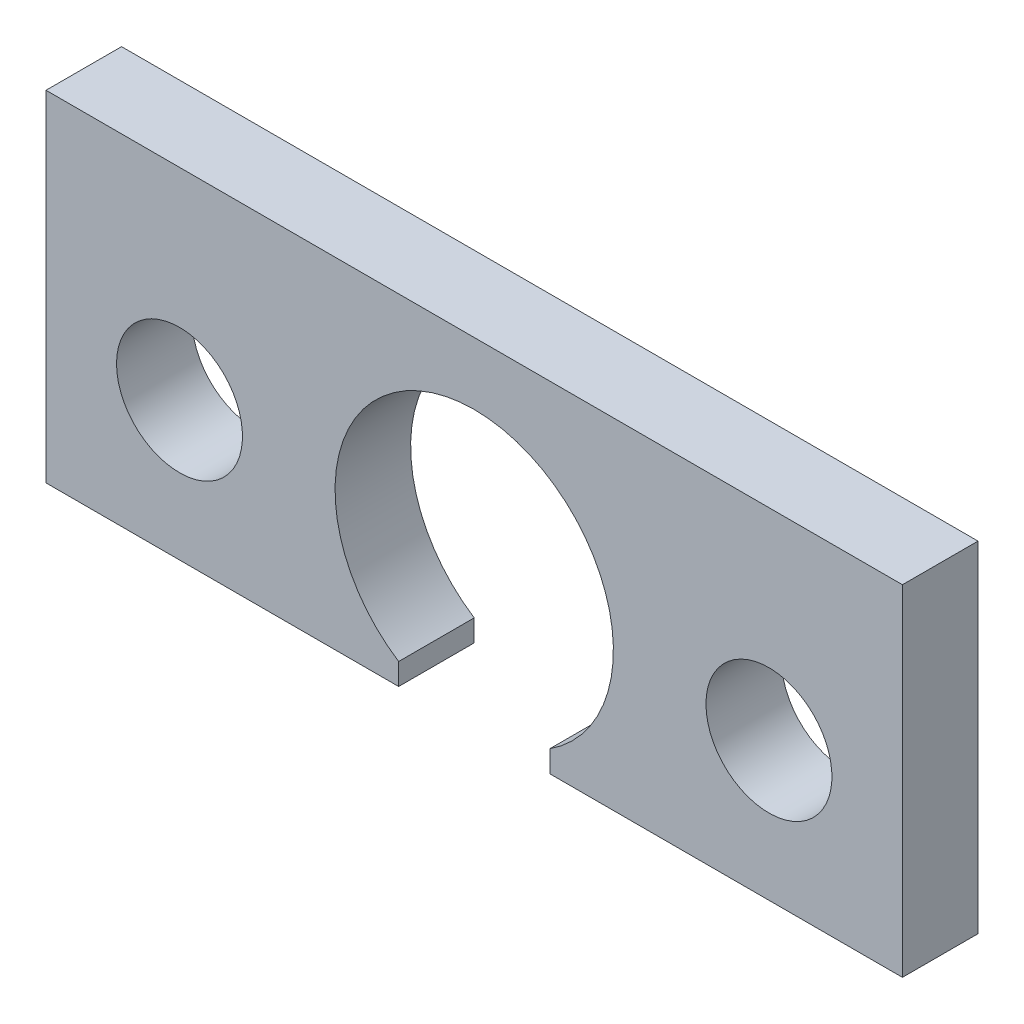
ISO-10303-21;
HEADER;
FILE_DESCRIPTION(('STEP AP214'),'2;1');
FILE_NAME('part.step','',(''),(''),'','','');
FILE_SCHEMA(('AUTOMOTIVE_DESIGN { 1 0 10303 214 1 1 1 1 }'));
ENDSEC;
DATA;
#1=APPLICATION_CONTEXT('core data for automotive mechanical design processes');
#2=APPLICATION_PROTOCOL_DEFINITION('international standard','automotive_design',2000,#1);
#3=PRODUCT_CONTEXT('',#1,'mechanical');
#4=PRODUCT('Part','Part','',(#3));
#5=PRODUCT_RELATED_PRODUCT_CATEGORY('part','',(#4));
#6=PRODUCT_DEFINITION_FORMATION('','',#4);
#7=PRODUCT_DEFINITION_CONTEXT('part definition',#1,'design');
#8=PRODUCT_DEFINITION('design','',#6,#7);
#9=PRODUCT_DEFINITION_SHAPE('','',#8);
#10=(LENGTH_UNIT() NAMED_UNIT(*) SI_UNIT(.MILLI.,.METRE.));
#11=(NAMED_UNIT(*) PLANE_ANGLE_UNIT() SI_UNIT($,.RADIAN.));
#12=(NAMED_UNIT(*) SI_UNIT($,.STERADIAN.) SOLID_ANGLE_UNIT());
#13=UNCERTAINTY_MEASURE_WITH_UNIT(LENGTH_MEASURE(1.E-05),#10,'distance_accuracy_value','');
#14=(GEOMETRIC_REPRESENTATION_CONTEXT(3) GLOBAL_UNCERTAINTY_ASSIGNED_CONTEXT((#13)) GLOBAL_UNIT_ASSIGNED_CONTEXT((#10,
#11,#12)) REPRESENTATION_CONTEXT('',''));
#15=CARTESIAN_POINT('',(0.,0.,0.));
#16=DIRECTION('',(0.,0.,1.));
#17=DIRECTION('',(1.,0.,0.));
#18=AXIS2_PLACEMENT_3D('',#15,#16,#17);
#19=CARTESIAN_POINT('',(-85.,40.0000000000004,29.9999999999997));
#20=DIRECTION('',(0.,0.999999999999998,0.));
#21=DIRECTION('',(0.,0.,1.00000000000002));
#22=AXIS2_PLACEMENT_3D('',#19,#20,#21);
#23=PLANE('',#22);
#24=DIRECTION('',(0.999999999999998,0.,0.));
#25=VECTOR('',#24,1.);
#26=CARTESIAN_POINT('',(-84.9999999999999,40.0000000000007,14.999999999999));
#27=LINE('',#26,#25);
#28=CARTESIAN_POINT('',(-84.9999999999999,40.0000000000007,14.999999999999));
#29=VERTEX_POINT('',#28);
#30=CARTESIAN_POINT('',(84.9999999999999,40.,15.0000000000005));
#31=VERTEX_POINT('',#30);
#32=EDGE_CURVE('E173',#29,#31,#27,.T.);
#33=ORIENTED_EDGE('',*,*,#32,.F.);
#34=DIRECTION('',(0.,0.,-1.00000000000002));
#35=VECTOR('',#34,1.);
#36=CARTESIAN_POINT('',(-85.,40.0000000000004,29.9999999999997));
#37=LINE('',#36,#35);
#38=CARTESIAN_POINT('',(-85.,40.0000000000004,29.9999999999997));
#39=VERTEX_POINT('',#38);
#40=EDGE_CURVE('E57',#39,#29,#37,.T.);
#41=ORIENTED_EDGE('',*,*,#40,.F.);
#42=DIRECTION('',(0.999999999999998,0.,0.));
#43=VECTOR('',#42,1.);
#44=CARTESIAN_POINT('',(-85.,40.0000000000004,29.9999999999997));
#45=LINE('',#44,#43);
#46=CARTESIAN_POINT('',(84.9999999999998,39.9999999999999,30.0000000000002));
#47=VERTEX_POINT('',#46);
#48=EDGE_CURVE('E133',#39,#47,#45,.T.);
#49=ORIENTED_EDGE('',*,*,#48,.T.);
#50=DIRECTION('',(0.,0.,-1.00000000000002));
#51=VECTOR('',#50,1.);
#52=CARTESIAN_POINT('',(84.9999999999998,39.9999999999999,30.0000000000002));
#53=LINE('',#52,#51);
#54=EDGE_CURVE('E11',#47,#31,#53,.T.);
#55=ORIENTED_EDGE('',*,*,#54,.T.);
#56=EDGE_LOOP('',(#33,#41,#49,#55));
#57=FACE_BOUND('',#56,.T.);
#58=ADVANCED_FACE('F46',(#57),#23,.T.);
#59=CARTESIAN_POINT('',(-85.0000000000002,27.5000000000001,29.9999999999999));
#60=DIRECTION('',(-0.999999999999998,0.,0.));
#61=DIRECTION('',(0.,0.,1.00000000000002));
#62=AXIS2_PLACEMENT_3D('',#59,#60,#61);
#63=PLANE('',#62);
#64=DIRECTION('',(0.,0.999999999999998,0.));
#65=VECTOR('',#64,1.);
#66=CARTESIAN_POINT('',(-85.0000000000002,27.5000000000001,14.9999999999995));
#67=LINE('',#66,#65);
#68=CARTESIAN_POINT('',(-84.9999999999999,-27.4999999999996,14.9999999999985));
#69=VERTEX_POINT('',#68);
#70=EDGE_CURVE('E117',#69,#29,#67,.T.);
#71=ORIENTED_EDGE('',*,*,#70,.F.);
#72=DIRECTION('',(0.,0.,-1.00000000000002));
#73=VECTOR('',#72,1.);
#74=CARTESIAN_POINT('',(-85.,-27.4999999999997,29.9999999999998));
#75=LINE('',#74,#73);
#76=CARTESIAN_POINT('',(-85.,-27.4999999999997,29.9999999999998));
#77=VERTEX_POINT('',#76);
#78=EDGE_CURVE('E113',#77,#69,#75,.T.);
#79=ORIENTED_EDGE('',*,*,#78,.F.);
#80=DIRECTION('',(0.,0.999999999999998,0.));
#81=VECTOR('',#80,1.);
#82=CARTESIAN_POINT('',(-85.0000000000002,27.5000000000001,29.9999999999999));
#83=LINE('',#82,#81);
#84=EDGE_CURVE('E116',#77,#39,#83,.T.);
#85=ORIENTED_EDGE('',*,*,#84,.T.);
#86=ORIENTED_EDGE('',*,*,#40,.T.);
#87=EDGE_LOOP('',(#71,#79,#85,#86));
#88=FACE_BOUND('',#87,.T.);
#89=ADVANCED_FACE('F115',(#88),#63,.T.);
#90=CARTESIAN_POINT('',(-14.9999999999998,-27.4999999999988,30.0000000000024));
#91=DIRECTION('',(0.,-0.999999999999999,0.));
#92=DIRECTION('',(0.999999999999998,0.,0.));
#93=AXIS2_PLACEMENT_3D('',#90,#91,#92);
#94=PLANE('',#93);
#95=DIRECTION('',(-0.999999999999998,0.,0.));
#96=VECTOR('',#95,1.);
#97=CARTESIAN_POINT('',(-14.9999999999998,-27.4999999999992,15.0000000000025));
#98=LINE('',#97,#96);
#99=CARTESIAN_POINT('',(-14.9999999999998,-27.4999999999992,15.0000000000025));
#100=VERTEX_POINT('',#99);
#101=EDGE_CURVE('E168',#100,#69,#98,.T.);
#102=ORIENTED_EDGE('',*,*,#101,.F.);
#103=DIRECTION('',(0.,0.,-1.00000000000002));
#104=VECTOR('',#103,1.);
#105=CARTESIAN_POINT('',(-14.9999999999998,-27.4999999999988,30.0000000000024));
#106=LINE('',#105,#104);
#107=CARTESIAN_POINT('',(-14.9999999999998,-27.4999999999988,30.0000000000024));
#108=VERTEX_POINT('',#107);
#109=EDGE_CURVE('E123',#108,#100,#106,.T.);
#110=ORIENTED_EDGE('',*,*,#109,.F.);
#111=DIRECTION('',(-0.999999999999998,0.,0.));
#112=VECTOR('',#111,1.);
#113=CARTESIAN_POINT('',(-14.9999999999998,-27.4999999999988,30.0000000000024));
#114=LINE('',#113,#112);
#115=EDGE_CURVE('E130',#108,#77,#114,.T.);
#116=ORIENTED_EDGE('',*,*,#115,.T.);
#117=ORIENTED_EDGE('',*,*,#78,.T.);
#118=EDGE_LOOP('',(#102,#110,#116,#117));
#119=FACE_BOUND('',#118,.T.);
#120=ADVANCED_FACE('F136',(#119),#94,.T.);
#121=CARTESIAN_POINT('',(-15.,-23.1978581985483,30.0000000000024));
#122=DIRECTION('',(0.999999999999998,0.,0.));
#123=DIRECTION('',(0.,0.,-1.00000000000002));
#124=AXIS2_PLACEMENT_3D('',#121,#122,#123);
#125=PLANE('',#124);
#126=DIRECTION('',(0.,-0.999999999999998,0.));
#127=VECTOR('',#126,1.);
#128=CARTESIAN_POINT('',(-15.,-23.1978581985484,15.0000000000022));
#129=LINE('',#128,#127);
#130=CARTESIAN_POINT('',(-15.,-23.1978581985484,15.0000000000022));
#131=VERTEX_POINT('',#130);
#132=EDGE_CURVE('E164',#131,#100,#129,.T.);
#133=ORIENTED_EDGE('',*,*,#132,.F.);
#134=DIRECTION('',(0.,0.,-1.00000000000002));
#135=VECTOR('',#134,1.);
#136=CARTESIAN_POINT('',(-15.,-23.1978581985483,30.0000000000024));
#137=LINE('',#136,#135);
#138=CARTESIAN_POINT('',(-15.,-23.1978581985483,30.0000000000024));
#139=VERTEX_POINT('',#138);
#140=EDGE_CURVE('E181',#139,#131,#137,.T.);
#141=ORIENTED_EDGE('',*,*,#140,.F.);
#142=DIRECTION('',(0.,-0.999999999999998,0.));
#143=VECTOR('',#142,1.);
#144=CARTESIAN_POINT('',(-15.,-23.1978581985483,30.0000000000024));
#145=LINE('',#144,#143);
#146=EDGE_CURVE('E138',#139,#108,#145,.T.);
#147=ORIENTED_EDGE('',*,*,#146,.T.);
#148=ORIENTED_EDGE('',*,*,#109,.T.);
#149=EDGE_LOOP('',(#133,#141,#147,#148));
#150=FACE_BOUND('',#149,.T.);
#151=ADVANCED_FACE('F240',(#150),#125,.T.);
#152=CARTESIAN_POINT('',(0.,2.77555756156289E-13,30.0000000000007));
#153=DIRECTION('',(0.,0.,-1.00000000000002));
#154=DIRECTION('',(-0.999999999999998,0.,0.));
#155=AXIS2_PLACEMENT_3D('',#152,#153,#154);
#156=CYLINDRICAL_SURFACE('',#155,27.625);
#157=CARTESIAN_POINT('',(1.11022302462516E-13,4.44089209850063E-13,14.9999999999999));
#158=DIRECTION('',(0.,0.,1.00000000000002));
#159=DIRECTION('',(-0.999999999999998,0.,0.));
#160=AXIS2_PLACEMENT_3D('',#157,#158,#159);
#161=CIRCLE('',#160,27.625);
#162=CARTESIAN_POINT('',(15.0000000000002,-23.1978581985484,15.0000000000002));
#163=VERTEX_POINT('',#162);
#164=EDGE_CURVE('E160',#163,#131,#161,.T.);
#165=ORIENTED_EDGE('',*,*,#164,.F.);
#166=DIRECTION('',(0.,0.,-1.00000000000002));
#167=VECTOR('',#166,1.);
#168=CARTESIAN_POINT('',(14.9999999999998,-23.1978581985488,30.0000000000006));
#169=LINE('',#168,#167);
#170=CARTESIAN_POINT('',(14.9999999999998,-23.1978581985488,30.0000000000006));
#171=VERTEX_POINT('',#170);
#172=EDGE_CURVE('E184',#171,#163,#169,.T.);
#173=ORIENTED_EDGE('',*,*,#172,.F.);
#174=CARTESIAN_POINT('',(0.,2.77555756156289E-13,30.0000000000007));
#175=DIRECTION('',(0.,0.,1.00000000000002));
#176=DIRECTION('',(-0.999999999999998,0.,0.));
#177=AXIS2_PLACEMENT_3D('',#174,#175,#176);
#178=CIRCLE('',#177,27.625);
#179=EDGE_CURVE('E142',#171,#139,#178,.T.);
#180=ORIENTED_EDGE('',*,*,#179,.T.);
#181=ORIENTED_EDGE('',*,*,#140,.T.);
#182=EDGE_LOOP('',(#165,#173,#180,#181));
#183=FACE_BOUND('',#182,.T.);
#184=ADVANCED_FACE('F225',(#183),#156,.F.);
#185=CARTESIAN_POINT('',(14.9999999999998,-23.1978581985488,30.0000000000006));
#186=DIRECTION('',(-0.999999999999998,0.,0.));
#187=DIRECTION('',(0.,0.,1.00000000000002));
#188=AXIS2_PLACEMENT_3D('',#185,#186,#187);
#189=PLANE('',#188);
#190=DIRECTION('',(0.,0.999999999999998,0.));
#191=VECTOR('',#190,1.);
#192=CARTESIAN_POINT('',(15.0000000000002,-23.1978581985484,15.0000000000002));
#193=LINE('',#192,#191);
#194=CARTESIAN_POINT('',(15.0000000000002,-27.4999999999988,15.0000000000002));
#195=VERTEX_POINT('',#194);
#196=EDGE_CURVE('E156',#195,#163,#193,.T.);
#197=ORIENTED_EDGE('',*,*,#196,.F.);
#198=DIRECTION('',(0.,0.,-1.00000000000002));
#199=VECTOR('',#198,1.);
#200=CARTESIAN_POINT('',(15.0000000000002,-27.4999999999991,30.0000000000007));
#201=LINE('',#200,#199);
#202=CARTESIAN_POINT('',(15.0000000000002,-27.4999999999991,30.0000000000007));
#203=VERTEX_POINT('',#202);
#204=EDGE_CURVE('E187',#203,#195,#201,.T.);
#205=ORIENTED_EDGE('',*,*,#204,.F.);
#206=DIRECTION('',(0.,0.999999999999998,0.));
#207=VECTOR('',#206,1.);
#208=CARTESIAN_POINT('',(14.9999999999998,-23.1978581985488,30.0000000000006));
#209=LINE('',#208,#207);
#210=EDGE_CURVE('E216',#203,#171,#209,.T.);
#211=ORIENTED_EDGE('',*,*,#210,.T.);
#212=ORIENTED_EDGE('',*,*,#172,.T.);
#213=EDGE_LOOP('',(#197,#205,#211,#212));
#214=FACE_BOUND('',#213,.T.);
#215=ADVANCED_FACE('F231',(#214),#189,.T.);
#216=CARTESIAN_POINT('',(15.0000000000002,-27.4999999999991,30.0000000000007));
#217=DIRECTION('',(0.,-0.999999999999999,0.));
#218=DIRECTION('',(0.999999999999998,0.,0.));
#219=AXIS2_PLACEMENT_3D('',#216,#217,#218);
#220=PLANE('',#219);
#221=DIRECTION('',(-0.999999999999998,0.,0.));
#222=VECTOR('',#221,1.);
#223=CARTESIAN_POINT('',(15.0000000000002,-27.4999999999988,15.0000000000002));
#224=LINE('',#223,#222);
#225=CARTESIAN_POINT('',(84.9999999999996,-27.5,14.9999999999998));
#226=VERTEX_POINT('',#225);
#227=EDGE_CURVE('E151',#226,#195,#224,.T.);
#228=ORIENTED_EDGE('',*,*,#227,.F.);
#229=DIRECTION('',(0.,0.,-1.00000000000002));
#230=VECTOR('',#229,1.);
#231=CARTESIAN_POINT('',(84.9999999999992,-27.5,30.0000000000002));
#232=LINE('',#231,#230);
#233=CARTESIAN_POINT('',(84.9999999999992,-27.5,30.0000000000002));
#234=VERTEX_POINT('',#233);
#235=EDGE_CURVE('E148',#234,#226,#232,.T.);
#236=ORIENTED_EDGE('',*,*,#235,.F.);
#237=DIRECTION('',(-0.999999999999998,0.,0.));
#238=VECTOR('',#237,1.);
#239=CARTESIAN_POINT('',(15.0000000000002,-27.4999999999991,30.0000000000007));
#240=LINE('',#239,#238);
#241=EDGE_CURVE('E212',#234,#203,#240,.T.);
#242=ORIENTED_EDGE('',*,*,#241,.T.);
#243=ORIENTED_EDGE('',*,*,#204,.T.);
#244=EDGE_LOOP('',(#228,#236,#242,#243));
#245=FACE_BOUND('',#244,.T.);
#246=ADVANCED_FACE('F234',(#245),#220,.T.);
#247=CARTESIAN_POINT('',(85.,27.5,30.0000000000006));
#248=DIRECTION('',(0.999999999999998,0.,0.));
#249=DIRECTION('',(0.,0.,-1.00000000000002));
#250=AXIS2_PLACEMENT_3D('',#247,#248,#249);
#251=PLANE('',#250);
#252=DIRECTION('',(0.,-0.999999999999998,0.));
#253=VECTOR('',#252,1.);
#254=CARTESIAN_POINT('',(84.9999999999999,27.5000000000001,15.0000000000002));
#255=LINE('',#254,#253);
#256=EDGE_CURVE('E95',#31,#226,#255,.T.);
#257=ORIENTED_EDGE('',*,*,#256,.F.);
#258=ORIENTED_EDGE('',*,*,#54,.F.);
#259=DIRECTION('',(0.,-0.999999999999998,0.));
#260=VECTOR('',#259,1.);
#261=CARTESIAN_POINT('',(84.9999999999998,39.9999999999999,30.0000000000002));
#262=LINE('',#261,#260);
#263=EDGE_CURVE('E98',#47,#234,#262,.T.);
#264=ORIENTED_EDGE('',*,*,#263,.T.);
#265=ORIENTED_EDGE('',*,*,#235,.T.);
#266=EDGE_LOOP('',(#257,#258,#264,#265));
#267=FACE_BOUND('',#266,.T.);
#268=ADVANCED_FACE('F48',(#267),#251,.T.);
#269=CARTESIAN_POINT('',(0.,2.77555756156289E-13,30.0000000000007));
#270=DIRECTION('',(0.,0.,-1.00000000000002));
#271=DIRECTION('',(-0.999999999999998,0.,0.));
#272=AXIS2_PLACEMENT_3D('',#269,#270,#271);
#273=PLANE('',#272);
#274=CARTESIAN_POINT('',(-58.5,2.91433543964104E-13,29.9999999999993));
#275=DIRECTION('',(0.,0.,-1.00000000000002));
#276=DIRECTION('',(-0.999999999999998,0.,0.));
#277=AXIS2_PLACEMENT_3D('',#274,#275,#276);
#278=CIRCLE('',#277,12.5);
#279=CARTESIAN_POINT('',(-71.,2.92127433354494E-13,29.9999999999993));
#280=VERTEX_POINT('',#279);
#281=EDGE_CURVE('E194',#280,#280,#278,.T.);
#282=ORIENTED_EDGE('',*,*,#281,.T.);
#283=EDGE_LOOP('',(#282));
#284=FACE_BOUND('',#283,.T.);
#285=CARTESIAN_POINT('',(58.4999999999998,6.31439345255558E-13,30.0000000000001));
#286=DIRECTION('',(0.,0.,-1.00000000000002));
#287=DIRECTION('',(-0.999999999999998,0.,0.));
#288=AXIS2_PLACEMENT_3D('',#285,#286,#287);
#289=CIRCLE('',#288,12.5);
#290=CARTESIAN_POINT('',(45.9999999999998,6.32133234645949E-13,30.0000000000001));
#291=VERTEX_POINT('',#290);
#292=EDGE_CURVE('E152',#291,#291,#289,.T.);
#293=ORIENTED_EDGE('',*,*,#292,.T.);
#294=EDGE_LOOP('',(#293));
#295=FACE_BOUND('',#294,.T.);
#296=ORIENTED_EDGE('',*,*,#263,.F.);
#297=ORIENTED_EDGE('',*,*,#48,.F.);
#298=ORIENTED_EDGE('',*,*,#84,.F.);
#299=ORIENTED_EDGE('',*,*,#115,.F.);
#300=ORIENTED_EDGE('',*,*,#146,.F.);
#301=ORIENTED_EDGE('',*,*,#179,.F.);
#302=ORIENTED_EDGE('',*,*,#210,.F.);
#303=ORIENTED_EDGE('',*,*,#241,.F.);
#304=EDGE_LOOP('',(#296,#297,#298,#299,#300,#301,#302,#303));
#305=FACE_BOUND('',#304,.T.);
#306=ADVANCED_FACE('F128',(#284,#295,#305),#273,.F.);
#307=CARTESIAN_POINT('',(1.11022302462516E-13,4.44089209850063E-13,14.9999999999999));
#308=DIRECTION('',(0.,0.,-1.00000000000002));
#309=DIRECTION('',(-0.999999999999998,0.,0.));
#310=AXIS2_PLACEMENT_3D('',#307,#308,#309);
#311=PLANE('',#310);
#312=CARTESIAN_POINT('',(-58.5000000000001,5.68989300120393E-13,14.9999999999992));
#313=DIRECTION('',(0.,0.,-1.00000000000002));
#314=DIRECTION('',(-0.999999999999998,0.,0.));
#315=AXIS2_PLACEMENT_3D('',#312,#313,#314);
#316=CIRCLE('',#315,12.5);
#317=CARTESIAN_POINT('',(-71.0000000000001,5.69683189510783E-13,14.9999999999992));
#318=VERTEX_POINT('',#317);
#319=EDGE_CURVE('E50',#318,#318,#316,.T.);
#320=ORIENTED_EDGE('',*,*,#319,.F.);
#321=EDGE_LOOP('',(#320));
#322=FACE_BOUND('',#321,.T.);
#323=CARTESIAN_POINT('',(58.4999999999999,6.31439345255558E-13,15.0000000000001));
#324=DIRECTION('',(0.,0.,-1.00000000000002));
#325=DIRECTION('',(-0.999999999999998,0.,0.));
#326=AXIS2_PLACEMENT_3D('',#323,#324,#325);
#327=CIRCLE('',#326,12.5);
#328=CARTESIAN_POINT('',(45.9999999999999,6.32133234645949E-13,15.0000000000001));
#329=VERTEX_POINT('',#328);
#330=EDGE_CURVE('E191',#329,#329,#327,.T.);
#331=ORIENTED_EDGE('',*,*,#330,.F.);
#332=EDGE_LOOP('',(#331));
#333=FACE_BOUND('',#332,.T.);
#334=ORIENTED_EDGE('',*,*,#32,.T.);
#335=ORIENTED_EDGE('',*,*,#256,.T.);
#336=ORIENTED_EDGE('',*,*,#227,.T.);
#337=ORIENTED_EDGE('',*,*,#196,.T.);
#338=ORIENTED_EDGE('',*,*,#164,.T.);
#339=ORIENTED_EDGE('',*,*,#132,.T.);
#340=ORIENTED_EDGE('',*,*,#101,.T.);
#341=ORIENTED_EDGE('',*,*,#70,.T.);
#342=EDGE_LOOP('',(#334,#335,#336,#337,#338,#339,#340,#341));
#343=FACE_BOUND('',#342,.T.);
#344=ADVANCED_FACE('F238',(#322,#333,#343),#311,.T.);
#345=CARTESIAN_POINT('',(58.4999999999999,5.20417042793042E-13,1.11022302462516E-13));
#346=DIRECTION('',(0.,0.,-1.00000000000002));
#347=DIRECTION('',(-0.999999999999998,0.,0.));
#348=AXIS2_PLACEMENT_3D('',#345,#346,#347);
#349=CYLINDRICAL_SURFACE('',#348,12.5);
#350=ORIENTED_EDGE('',*,*,#330,.T.);
#351=EDGE_LOOP('',(#350));
#352=FACE_BOUND('',#351,.T.);
#353=ORIENTED_EDGE('',*,*,#292,.F.);
#354=EDGE_LOOP('',(#353));
#355=FACE_BOUND('',#354,.T.);
#356=ADVANCED_FACE('F261',(#352,#355),#349,.F.);
#357=CARTESIAN_POINT('',(-58.4999999999998,2.35922392732846E-13,-7.7715611723761E-13));
#358=DIRECTION('',(0.,0.,-1.00000000000002));
#359=DIRECTION('',(-0.999999999999998,0.,0.));
#360=AXIS2_PLACEMENT_3D('',#357,#358,#359);
#361=CYLINDRICAL_SURFACE('',#360,12.5);
#362=ORIENTED_EDGE('',*,*,#319,.T.);
#363=EDGE_LOOP('',(#362));
#364=FACE_BOUND('',#363,.T.);
#365=ORIENTED_EDGE('',*,*,#281,.F.);
#366=EDGE_LOOP('',(#365));
#367=FACE_BOUND('',#366,.T.);
#368=ADVANCED_FACE('F267',(#364,#367),#361,.F.);
#369=CLOSED_SHELL('',(#58,#89,#120,#151,#184,#215,#246,#268,#306,#344,#356,#368));
#370=MANIFOLD_SOLID_BREP('B2',#369);
#371=ADVANCED_BREP_SHAPE_REPRESENTATION('',(#18,#370),#14);
#372=SHAPE_DEFINITION_REPRESENTATION(#9,#371);
ENDSEC;
END-ISO-10303-21;
